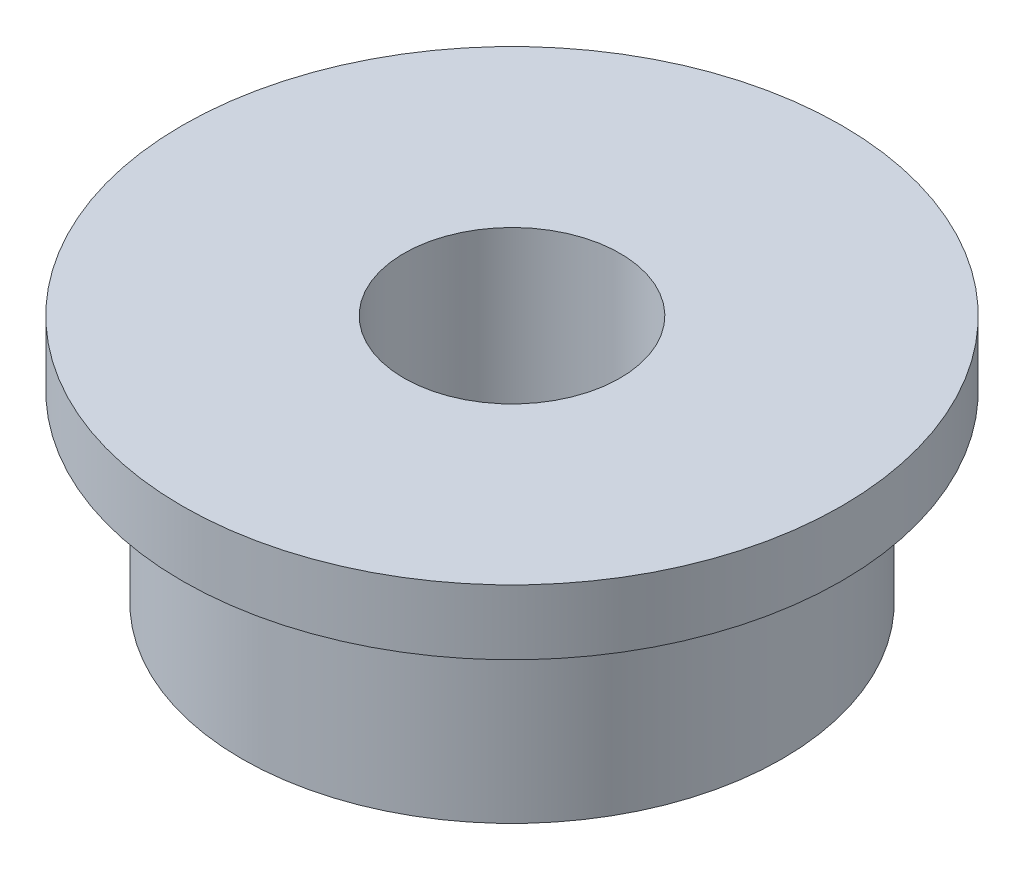
ISO-10303-21;
HEADER;
FILE_DESCRIPTION(('STEP AP214'),'2;1');
FILE_NAME('part.step','',(''),(''),'','','');
FILE_SCHEMA(('AUTOMOTIVE_DESIGN { 1 0 10303 214 1 1 1 1 }'));
ENDSEC;
DATA;
#1=APPLICATION_CONTEXT('core data for automotive mechanical design processes');
#2=APPLICATION_PROTOCOL_DEFINITION('international standard','automotive_design',2000,#1);
#3=PRODUCT_CONTEXT('',#1,'mechanical');
#4=PRODUCT('Part','Part','',(#3));
#5=PRODUCT_RELATED_PRODUCT_CATEGORY('part','',(#4));
#6=PRODUCT_DEFINITION_FORMATION('','',#4);
#7=PRODUCT_DEFINITION_CONTEXT('part definition',#1,'design');
#8=PRODUCT_DEFINITION('design','',#6,#7);
#9=PRODUCT_DEFINITION_SHAPE('','',#8);
#10=(LENGTH_UNIT() NAMED_UNIT(*) SI_UNIT(.MILLI.,.METRE.));
#11=(NAMED_UNIT(*) PLANE_ANGLE_UNIT() SI_UNIT($,.RADIAN.));
#12=(NAMED_UNIT(*) SI_UNIT($,.STERADIAN.) SOLID_ANGLE_UNIT());
#13=UNCERTAINTY_MEASURE_WITH_UNIT(LENGTH_MEASURE(1.E-05),#10,'distance_accuracy_value','');
#14=(GEOMETRIC_REPRESENTATION_CONTEXT(3) GLOBAL_UNCERTAINTY_ASSIGNED_CONTEXT((#13)) GLOBAL_UNIT_ASSIGNED_CONTEXT((#10,
#11,#12)) REPRESENTATION_CONTEXT('',''));
#15=CARTESIAN_POINT('',(0.,0.,0.));
#16=DIRECTION('',(0.,0.,1.));
#17=DIRECTION('',(1.,0.,0.));
#18=AXIS2_PLACEMENT_3D('',#15,#16,#17);
#19=CARTESIAN_POINT('',(0.,2.3,0.));
#20=DIRECTION('',(0.,-1.,0.));
#21=DIRECTION('',(0.,0.,-1.));
#22=AXIS2_PLACEMENT_3D('',#19,#20,#21);
#23=CYLINDRICAL_SURFACE('',#22,2.5);
#24=CARTESIAN_POINT('',(0.,0.,0.));
#25=DIRECTION('',(0.,1.,0.));
#26=DIRECTION('',(0.,0.,1.));
#27=AXIS2_PLACEMENT_3D('',#24,#25,#26);
#28=CIRCLE('',#27,2.5);
#29=CARTESIAN_POINT('',(0.,0.,2.5));
#30=VERTEX_POINT('',#29);
#31=EDGE_CURVE('E35',#30,#30,#28,.T.);
#32=ORIENTED_EDGE('',*,*,#31,.T.);
#33=EDGE_LOOP('',(#32));
#34=FACE_BOUND('',#33,.T.);
#35=CARTESIAN_POINT('',(0.,1.7,0.));
#36=DIRECTION('',(0.,1.,0.));
#37=DIRECTION('',(0.,0.,1.));
#38=AXIS2_PLACEMENT_3D('',#35,#36,#37);
#39=CIRCLE('',#38,2.5);
#40=CARTESIAN_POINT('',(0.,1.7,2.5));
#41=VERTEX_POINT('',#40);
#42=EDGE_CURVE('E10',#41,#41,#39,.T.);
#43=ORIENTED_EDGE('',*,*,#42,.F.);
#44=EDGE_LOOP('',(#43));
#45=FACE_BOUND('',#44,.T.);
#46=ADVANCED_FACE('F32',(#34,#45),#23,.T.);
#47=CARTESIAN_POINT('',(0.,2.3,0.));
#48=DIRECTION('',(0.,1.,0.));
#49=DIRECTION('',(0.,0.,1.));
#50=AXIS2_PLACEMENT_3D('',#47,#48,#49);
#51=PLANE('',#50);
#52=CARTESIAN_POINT('',(0.,2.3,0.));
#53=DIRECTION('',(0.,1.,0.));
#54=DIRECTION('',(0.,0.,1.));
#55=AXIS2_PLACEMENT_3D('',#52,#53,#54);
#56=CIRCLE('',#55,1.);
#57=CARTESIAN_POINT('',(0.,2.3,1.));
#58=VERTEX_POINT('',#57);
#59=EDGE_CURVE('E43',#58,#58,#56,.T.);
#60=ORIENTED_EDGE('',*,*,#59,.F.);
#61=EDGE_LOOP('',(#60));
#62=FACE_BOUND('',#61,.T.);
#63=CARTESIAN_POINT('',(0.,2.3,0.));
#64=DIRECTION('',(0.,1.,0.));
#65=DIRECTION('',(0.,0.,1.));
#66=AXIS2_PLACEMENT_3D('',#63,#64,#65);
#67=CIRCLE('',#66,3.05);
#68=CARTESIAN_POINT('',(0.,2.3,3.05));
#69=VERTEX_POINT('',#68);
#70=EDGE_CURVE('E46',#69,#69,#67,.T.);
#71=ORIENTED_EDGE('',*,*,#70,.T.);
#72=EDGE_LOOP('',(#71));
#73=FACE_BOUND('',#72,.T.);
#74=ADVANCED_FACE('F60',(#62,#73),#51,.T.);
#75=CARTESIAN_POINT('',(0.,0.,0.));
#76=DIRECTION('',(0.,1.,0.));
#77=DIRECTION('',(0.,0.,1.));
#78=AXIS2_PLACEMENT_3D('',#75,#76,#77);
#79=PLANE('',#78);
#80=ORIENTED_EDGE('',*,*,#31,.F.);
#81=EDGE_LOOP('',(#80));
#82=FACE_BOUND('',#81,.T.);
#83=CARTESIAN_POINT('',(0.,0.,0.));
#84=DIRECTION('',(0.,1.,0.));
#85=DIRECTION('',(0.,0.,1.));
#86=AXIS2_PLACEMENT_3D('',#83,#84,#85);
#87=CIRCLE('',#86,1.);
#88=CARTESIAN_POINT('',(0.,0.,1.));
#89=VERTEX_POINT('',#88);
#90=EDGE_CURVE('E49',#89,#89,#87,.T.);
#91=ORIENTED_EDGE('',*,*,#90,.T.);
#92=EDGE_LOOP('',(#91));
#93=FACE_BOUND('',#92,.T.);
#94=ADVANCED_FACE('F78',(#82,#93),#79,.F.);
#95=CARTESIAN_POINT('',(0.,2.3,0.));
#96=DIRECTION('',(0.,-1.,0.));
#97=DIRECTION('',(0.,0.,-1.));
#98=AXIS2_PLACEMENT_3D('',#95,#96,#97);
#99=CYLINDRICAL_SURFACE('',#98,1.);
#100=ORIENTED_EDGE('',*,*,#59,.T.);
#101=EDGE_LOOP('',(#100));
#102=FACE_BOUND('',#101,.T.);
#103=ORIENTED_EDGE('',*,*,#90,.F.);
#104=EDGE_LOOP('',(#103));
#105=FACE_BOUND('',#104,.T.);
#106=ADVANCED_FACE('F69',(#102,#105),#99,.F.);
#107=CARTESIAN_POINT('',(0.,1.7,0.));
#108=DIRECTION('',(0.,1.,0.));
#109=DIRECTION('',(0.,0.,1.));
#110=AXIS2_PLACEMENT_3D('',#107,#108,#109);
#111=PLANE('',#110);
#112=CARTESIAN_POINT('',(0.,1.7,0.));
#113=DIRECTION('',(0.,1.,0.));
#114=DIRECTION('',(0.,0.,1.));
#115=AXIS2_PLACEMENT_3D('',#112,#113,#114);
#116=CIRCLE('',#115,3.05);
#117=CARTESIAN_POINT('',(0.,1.7,3.05));
#118=VERTEX_POINT('',#117);
#119=EDGE_CURVE('E51',#118,#118,#116,.T.);
#120=ORIENTED_EDGE('',*,*,#119,.F.);
#121=EDGE_LOOP('',(#120));
#122=FACE_BOUND('',#121,.T.);
#123=ORIENTED_EDGE('',*,*,#42,.T.);
#124=EDGE_LOOP('',(#123));
#125=FACE_BOUND('',#124,.T.);
#126=ADVANCED_FACE('F64',(#122,#125),#111,.F.);
#127=CARTESIAN_POINT('',(0.,1.7,0.));
#128=DIRECTION('',(0.,1.,0.));
#129=DIRECTION('',(0.,0.,1.));
#130=AXIS2_PLACEMENT_3D('',#127,#128,#129);
#131=CYLINDRICAL_SURFACE('',#130,3.05);
#132=ORIENTED_EDGE('',*,*,#119,.T.);
#133=EDGE_LOOP('',(#132));
#134=FACE_BOUND('',#133,.T.);
#135=ORIENTED_EDGE('',*,*,#70,.F.);
#136=EDGE_LOOP('',(#135));
#137=FACE_BOUND('',#136,.T.);
#138=ADVANCED_FACE('F62',(#134,#137),#131,.T.);
#139=CLOSED_SHELL('',(#46,#74,#94,#106,#126,#138));
#140=MANIFOLD_SOLID_BREP('B2',#139);
#141=ADVANCED_BREP_SHAPE_REPRESENTATION('',(#18,#140),#14);
#142=SHAPE_DEFINITION_REPRESENTATION(#9,#141);
ENDSEC;
END-ISO-10303-21;
